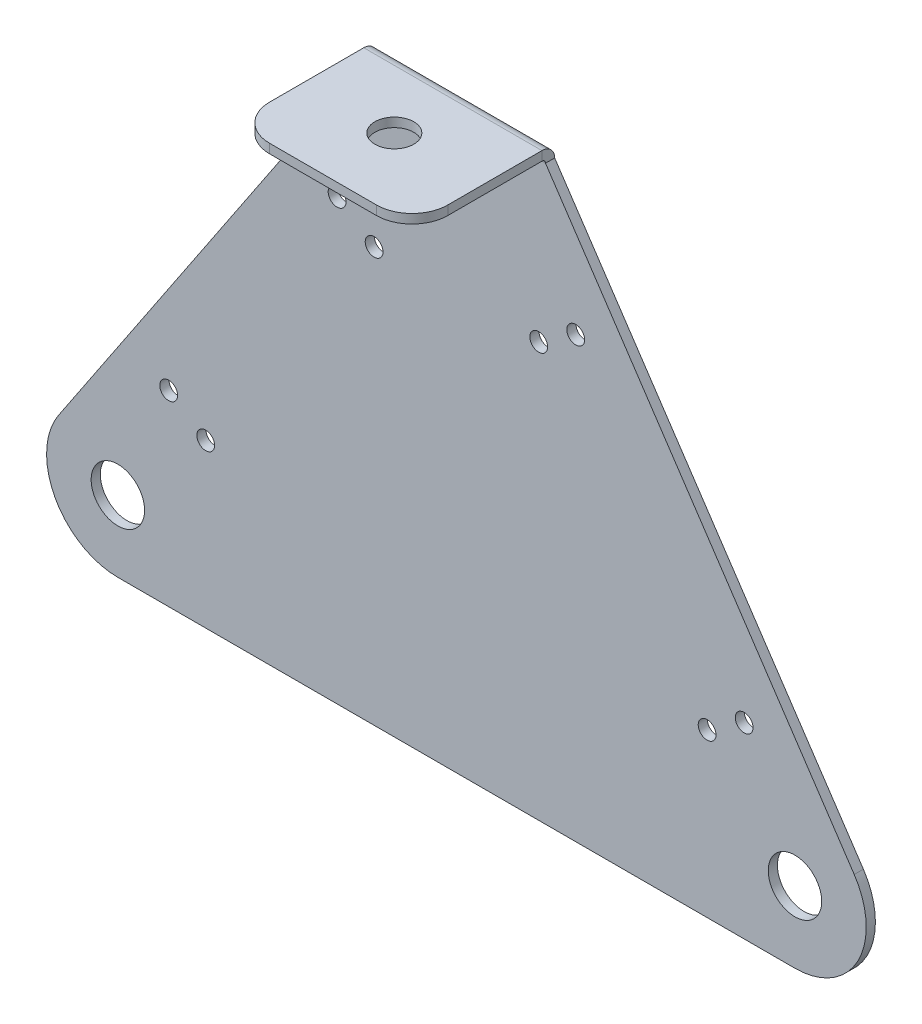
ISO-10303-21;
HEADER;
FILE_DESCRIPTION(('STEP AP214'),'2;1');
FILE_NAME('part.step','',(''),(''),'','','');
FILE_SCHEMA(('AUTOMOTIVE_DESIGN { 1 0 10303 214 1 1 1 1 }'));
ENDSEC;
DATA;
#1=APPLICATION_CONTEXT('core data for automotive mechanical design processes');
#2=APPLICATION_PROTOCOL_DEFINITION('international standard','automotive_design',2000,#1);
#3=PRODUCT_CONTEXT('',#1,'mechanical');
#4=PRODUCT('Part','Part','',(#3));
#5=PRODUCT_RELATED_PRODUCT_CATEGORY('part','',(#4));
#6=PRODUCT_DEFINITION_FORMATION('','',#4);
#7=PRODUCT_DEFINITION_CONTEXT('part definition',#1,'design');
#8=PRODUCT_DEFINITION('design','',#6,#7);
#9=PRODUCT_DEFINITION_SHAPE('','',#8);
#10=(LENGTH_UNIT() NAMED_UNIT(*) SI_UNIT(.MILLI.,.METRE.));
#11=(NAMED_UNIT(*) PLANE_ANGLE_UNIT() SI_UNIT($,.RADIAN.));
#12=(NAMED_UNIT(*) SI_UNIT($,.STERADIAN.) SOLID_ANGLE_UNIT());
#13=UNCERTAINTY_MEASURE_WITH_UNIT(LENGTH_MEASURE(1.E-05),#10,'distance_accuracy_value','');
#14=(GEOMETRIC_REPRESENTATION_CONTEXT(3) GLOBAL_UNCERTAINTY_ASSIGNED_CONTEXT((#13)) GLOBAL_UNIT_ASSIGNED_CONTEXT((#10,
#11,#12)) REPRESENTATION_CONTEXT('',''));
#15=CARTESIAN_POINT('',(0.,0.,0.));
#16=DIRECTION('',(0.,0.,1.));
#17=DIRECTION('',(1.,0.,0.));
#18=AXIS2_PLACEMENT_3D('',#15,#16,#17);
#19=CARTESIAN_POINT('',(-31.75,-30.356048,-3.2639));
#20=DIRECTION('',(-0.831233772338878,0.555923030394747,0.));
#21=DIRECTION('',(-0.555923030394747,-0.831233772338878,0.));
#22=AXIS2_PLACEMENT_3D('',#19,#20,#21);
#23=PLANE('',#22);
#24=DIRECTION('',(-0.555923030394747,-0.831233772338878,0.));
#25=VECTOR('',#24,1.);
#26=CARTESIAN_POINT('',(-31.75,-30.356048,0.));
#27=LINE('',#26,#25);
#28=CARTESIAN_POINT('',(-31.75,-30.356048,0.));
#29=VERTEX_POINT('',#28);
#30=CARTESIAN_POINT('',(-141.763337817408,-194.851484961158,0.));
#31=VERTEX_POINT('',#30);
#32=EDGE_CURVE('E261',#29,#31,#27,.T.);
#33=ORIENTED_EDGE('',*,*,#32,.F.);
#34=DIRECTION('',(0.,0.,1.));
#35=VECTOR('',#34,1.);
#36=CARTESIAN_POINT('',(-31.75,-30.356048,-3.2639));
#37=LINE('',#36,#35);
#38=CARTESIAN_POINT('',(-31.75,-30.356048,-3.2639));
#39=VERTEX_POINT('',#38);
#40=EDGE_CURVE('E297',#39,#29,#37,.T.);
#41=ORIENTED_EDGE('',*,*,#40,.F.);
#42=DIRECTION('',(-0.555923030394747,-0.831233772338878,0.));
#43=VECTOR('',#42,1.);
#44=CARTESIAN_POINT('',(-31.75,-30.356048,-3.2639));
#45=LINE('',#44,#43);
#46=CARTESIAN_POINT('',(-141.763337817408,-194.851484961158,-3.2639));
#47=VERTEX_POINT('',#46);
#48=EDGE_CURVE('E264',#39,#47,#45,.T.);
#49=ORIENTED_EDGE('',*,*,#48,.T.);
#50=DIRECTION('',(0.,0.,1.));
#51=VECTOR('',#50,1.);
#52=CARTESIAN_POINT('',(-141.763337817408,-194.851484961158,-3.2639));
#53=LINE('',#52,#51);
#54=EDGE_CURVE('E280',#47,#31,#53,.T.);
#55=ORIENTED_EDGE('',*,*,#54,.T.);
#56=EDGE_LOOP('',(#33,#41,#49,#55));
#57=FACE_BOUND('',#56,.T.);
#58=ADVANCED_FACE('F59',(#57),#23,.T.);
#59=CARTESIAN_POINT('',(31.75,-30.356048,-3.2639));
#60=DIRECTION('',(0.831233772338878,0.555923030394747,0.));
#61=DIRECTION('',(-0.555923030394747,0.831233772338878,0.));
#62=AXIS2_PLACEMENT_3D('',#59,#60,#61);
#63=PLANE('',#62);
#64=DIRECTION('',(-0.555923030394747,0.831233772338878,0.));
#65=VECTOR('',#64,1.);
#66=CARTESIAN_POINT('',(31.75,-30.356048,0.));
#67=LINE('',#66,#65);
#68=CARTESIAN_POINT('',(141.763337817408,-194.851484961158,0.));
#69=VERTEX_POINT('',#68);
#70=CARTESIAN_POINT('',(31.75,-30.356048,0.));
#71=VERTEX_POINT('',#70);
#72=EDGE_CURVE('E292',#69,#71,#67,.T.);
#73=ORIENTED_EDGE('',*,*,#72,.F.);
#74=DIRECTION('',(0.,0.,1.));
#75=VECTOR('',#74,1.);
#76=CARTESIAN_POINT('',(141.763337817408,-194.851484961158,-3.2639));
#77=LINE('',#76,#75);
#78=CARTESIAN_POINT('',(141.763337817408,-194.851484961158,-3.2639));
#79=VERTEX_POINT('',#78);
#80=EDGE_CURVE('E302',#79,#69,#77,.T.);
#81=ORIENTED_EDGE('',*,*,#80,.F.);
#82=DIRECTION('',(-0.555923030394747,0.831233772338878,0.));
#83=VECTOR('',#82,1.);
#84=CARTESIAN_POINT('',(31.75,-30.356048,-3.2639));
#85=LINE('',#84,#83);
#86=CARTESIAN_POINT('',(31.75,-30.356048,-3.2639));
#87=VERTEX_POINT('',#86);
#88=EDGE_CURVE('E277',#79,#87,#85,.T.);
#89=ORIENTED_EDGE('',*,*,#88,.T.);
#90=DIRECTION('',(0.,0.,1.));
#91=VECTOR('',#90,1.);
#92=CARTESIAN_POINT('',(31.75,-30.356048,-3.2639));
#93=LINE('',#92,#91);
#94=EDGE_CURVE('E300',#87,#71,#93,.T.);
#95=ORIENTED_EDGE('',*,*,#94,.T.);
#96=EDGE_LOOP('',(#73,#81,#89,#95));
#97=FACE_BOUND('',#96,.T.);
#98=ADVANCED_FACE('F344',(#97),#63,.T.);
#99=CARTESIAN_POINT('',(120.65,-208.971929933185,-3.2639));
#100=DIRECTION('',(0.,0.,1.));
#101=DIRECTION('',(1.,0.,0.));
#102=AXIS2_PLACEMENT_3D('',#99,#100,#101);
#103=CYLINDRICAL_SURFACE('',#102,25.4);
#104=CARTESIAN_POINT('',(120.65,-208.971929933185,0.));
#105=DIRECTION('',(0.,0.,1.));
#106=DIRECTION('',(-1.,0.,0.));
#107=AXIS2_PLACEMENT_3D('',#104,#105,#106);
#108=CIRCLE('',#107,25.4);
#109=CARTESIAN_POINT('',(120.65,-234.371929933185,0.));
#110=VERTEX_POINT('',#109);
#111=EDGE_CURVE('E289',#110,#69,#108,.T.);
#112=ORIENTED_EDGE('',*,*,#111,.F.);
#113=DIRECTION('',(0.,0.,1.));
#114=VECTOR('',#113,1.);
#115=CARTESIAN_POINT('',(120.65,-234.371929933185,-3.2639));
#116=LINE('',#115,#114);
#117=CARTESIAN_POINT('',(120.65,-234.371929933185,-3.2639));
#118=VERTEX_POINT('',#117);
#119=EDGE_CURVE('E304',#118,#110,#116,.T.);
#120=ORIENTED_EDGE('',*,*,#119,.F.);
#121=CARTESIAN_POINT('',(120.65,-208.971929933185,-3.2639));
#122=DIRECTION('',(0.,0.,1.));
#123=DIRECTION('',(-1.,0.,0.));
#124=AXIS2_PLACEMENT_3D('',#121,#122,#123);
#125=CIRCLE('',#124,25.4);
#126=EDGE_CURVE('E274',#118,#79,#125,.T.);
#127=ORIENTED_EDGE('',*,*,#126,.T.);
#128=ORIENTED_EDGE('',*,*,#80,.T.);
#129=EDGE_LOOP('',(#112,#120,#127,#128));
#130=FACE_BOUND('',#129,.T.);
#131=ADVANCED_FACE('F351',(#130),#103,.T.);
#132=CARTESIAN_POINT('',(-120.65,-234.371929933185,-3.2639));
#133=DIRECTION('',(0.,-1.,0.));
#134=DIRECTION('',(1.,0.,0.));
#135=AXIS2_PLACEMENT_3D('',#132,#133,#134);
#136=PLANE('',#135);
#137=DIRECTION('',(1.,0.,0.));
#138=VECTOR('',#137,1.);
#139=CARTESIAN_POINT('',(-120.65,-234.371929933185,0.));
#140=LINE('',#139,#138);
#141=CARTESIAN_POINT('',(-120.65,-234.371929933185,0.));
#142=VERTEX_POINT('',#141);
#143=EDGE_CURVE('E286',#142,#110,#140,.T.);
#144=ORIENTED_EDGE('',*,*,#143,.F.);
#145=DIRECTION('',(0.,0.,1.));
#146=VECTOR('',#145,1.);
#147=CARTESIAN_POINT('',(-120.65,-234.371929933185,-3.2639));
#148=LINE('',#147,#146);
#149=CARTESIAN_POINT('',(-120.65,-234.371929933185,-3.2639));
#150=VERTEX_POINT('',#149);
#151=EDGE_CURVE('E306',#150,#142,#148,.T.);
#152=ORIENTED_EDGE('',*,*,#151,.F.);
#153=DIRECTION('',(1.,0.,0.));
#154=VECTOR('',#153,1.);
#155=CARTESIAN_POINT('',(-120.65,-234.371929933185,-3.2639));
#156=LINE('',#155,#154);
#157=EDGE_CURVE('E271',#150,#118,#156,.T.);
#158=ORIENTED_EDGE('',*,*,#157,.T.);
#159=ORIENTED_EDGE('',*,*,#119,.T.);
#160=EDGE_LOOP('',(#144,#152,#158,#159));
#161=FACE_BOUND('',#160,.T.);
#162=ADVANCED_FACE('F363',(#161),#136,.T.);
#163=CARTESIAN_POINT('',(-120.65,-208.971929933185,-3.2639));
#164=DIRECTION('',(0.,0.,1.));
#165=DIRECTION('',(1.,0.,0.));
#166=AXIS2_PLACEMENT_3D('',#163,#164,#165);
#167=CYLINDRICAL_SURFACE('',#166,25.4);
#168=CARTESIAN_POINT('',(-120.65,-208.971929933185,0.));
#169=DIRECTION('',(0.,0.,1.));
#170=DIRECTION('',(1.,0.,0.));
#171=AXIS2_PLACEMENT_3D('',#168,#169,#170);
#172=CIRCLE('',#171,25.4);
#173=EDGE_CURVE('E283',#31,#142,#172,.T.);
#174=ORIENTED_EDGE('',*,*,#173,.F.);
#175=ORIENTED_EDGE('',*,*,#54,.F.);
#176=CARTESIAN_POINT('',(-120.65,-208.971929933185,-3.2639));
#177=DIRECTION('',(0.,0.,1.));
#178=DIRECTION('',(1.,0.,0.));
#179=AXIS2_PLACEMENT_3D('',#176,#177,#178);
#180=CIRCLE('',#179,25.4);
#181=EDGE_CURVE('E267',#47,#150,#180,.T.);
#182=ORIENTED_EDGE('',*,*,#181,.T.);
#183=ORIENTED_EDGE('',*,*,#151,.T.);
#184=EDGE_LOOP('',(#174,#175,#182,#183));
#185=FACE_BOUND('',#184,.T.);
#186=ADVANCED_FACE('F361',(#185),#167,.T.);
#187=CARTESIAN_POINT('',(-120.65,-208.971929933185,-3.2639));
#188=DIRECTION('',(0.,0.,1.));
#189=DIRECTION('',(1.,0.,0.));
#190=AXIS2_PLACEMENT_3D('',#187,#188,#189);
#191=PLANE('',#190);
#192=CARTESIAN_POINT('',(-102.537139366894,-167.610949698963,-3.2639));
#193=DIRECTION('',(0.,0.,1.));
#194=DIRECTION('',(1.,0.,0.));
#195=AXIS2_PLACEMENT_3D('',#192,#193,#194);
#196=CIRCLE('',#195,3.175);
#197=CARTESIAN_POINT('',(-99.3621393668936,-167.610949698963,-3.2639));
#198=VERTEX_POINT('',#197);
#199=EDGE_CURVE('E206',#198,#198,#196,.T.);
#200=ORIENTED_EDGE('',*,*,#199,.T.);
#201=EDGE_LOOP('',(#200));
#202=FACE_BOUND('',#201,.T.);
#203=CARTESIAN_POINT('',(-89.3413032310139,-176.43622780648,-3.2639));
#204=DIRECTION('',(0.,0.,1.));
#205=DIRECTION('',(1.,0.,0.));
#206=AXIS2_PLACEMENT_3D('',#203,#204,#205);
#207=CIRCLE('',#206,3.175);
#208=CARTESIAN_POINT('',(-86.1663032310139,-176.43622780648,-3.2639));
#209=VERTEX_POINT('',#208);
#210=EDGE_CURVE('E212',#209,#209,#207,.T.);
#211=ORIENTED_EDGE('',*,*,#210,.T.);
#212=EDGE_LOOP('',(#211));
#213=FACE_BOUND('',#212,.T.);
#214=CARTESIAN_POINT('',(-42.5252482357807,-77.8792639749816,-3.2639));
#215=DIRECTION('',(0.,0.,1.));
#216=DIRECTION('',(1.,0.,0.));
#217=AXIS2_PLACEMENT_3D('',#214,#215,#216);
#218=CIRCLE('',#217,3.175);
#219=CARTESIAN_POINT('',(-39.3502482357807,-77.8792639749816,-3.2639));
#220=VERTEX_POINT('',#219);
#221=EDGE_CURVE('E218',#220,#220,#218,.T.);
#222=ORIENTED_EDGE('',*,*,#221,.T.);
#223=EDGE_LOOP('',(#222));
#224=FACE_BOUND('',#223,.T.);
#225=CARTESIAN_POINT('',(-29.329412099901,-86.7045420824982,-3.2639));
#226=DIRECTION('',(0.,0.,1.));
#227=DIRECTION('',(1.,0.,0.));
#228=AXIS2_PLACEMENT_3D('',#225,#226,#227);
#229=CIRCLE('',#228,3.175);
#230=CARTESIAN_POINT('',(-26.154412099901,-86.7045420824982,-3.2639));
#231=VERTEX_POINT('',#230);
#232=EDGE_CURVE('E224',#231,#231,#229,.T.);
#233=ORIENTED_EDGE('',*,*,#232,.T.);
#234=EDGE_LOOP('',(#233));
#235=FACE_BOUND('',#234,.T.);
#236=CARTESIAN_POINT('',(29.3294120999009,-86.7045420824982,-3.2639));
#237=DIRECTION('',(0.,0.,1.));
#238=DIRECTION('',(1.,0.,0.));
#239=AXIS2_PLACEMENT_3D('',#236,#237,#238);
#240=CIRCLE('',#239,3.175);
#241=CARTESIAN_POINT('',(32.5044120999009,-86.7045420824982,-3.2639));
#242=VERTEX_POINT('',#241);
#243=EDGE_CURVE('E230',#242,#242,#240,.T.);
#244=ORIENTED_EDGE('',*,*,#243,.T.);
#245=EDGE_LOOP('',(#244));
#246=FACE_BOUND('',#245,.T.);
#247=CARTESIAN_POINT('',(42.5252482357807,-77.8792639749815,-3.2639));
#248=DIRECTION('',(0.,0.,1.));
#249=DIRECTION('',(1.,0.,0.));
#250=AXIS2_PLACEMENT_3D('',#247,#248,#249);
#251=CIRCLE('',#250,3.175);
#252=CARTESIAN_POINT('',(45.7002482357807,-77.8792639749815,-3.2639));
#253=VERTEX_POINT('',#252);
#254=EDGE_CURVE('E236',#253,#253,#251,.T.);
#255=ORIENTED_EDGE('',*,*,#254,.T.);
#256=EDGE_LOOP('',(#255));
#257=FACE_BOUND('',#256,.T.);
#258=CARTESIAN_POINT('',(89.3413032310139,-176.43622780648,-3.2639));
#259=DIRECTION('',(0.,0.,1.));
#260=DIRECTION('',(1.,0.,0.));
#261=AXIS2_PLACEMENT_3D('',#258,#259,#260);
#262=CIRCLE('',#261,3.175);
#263=CARTESIAN_POINT('',(92.5163032310139,-176.43622780648,-3.2639));
#264=VERTEX_POINT('',#263);
#265=EDGE_CURVE('E242',#264,#264,#262,.T.);
#266=ORIENTED_EDGE('',*,*,#265,.T.);
#267=EDGE_LOOP('',(#266));
#268=FACE_BOUND('',#267,.T.);
#269=CARTESIAN_POINT('',(102.537139366894,-167.610949698963,-3.2639));
#270=DIRECTION('',(0.,0.,1.));
#271=DIRECTION('',(1.,0.,0.));
#272=AXIS2_PLACEMENT_3D('',#269,#270,#271);
#273=CIRCLE('',#272,3.175);
#274=CARTESIAN_POINT('',(105.712139366894,-167.610949698963,-3.2639));
#275=VERTEX_POINT('',#274);
#276=EDGE_CURVE('E248',#275,#275,#273,.T.);
#277=ORIENTED_EDGE('',*,*,#276,.T.);
#278=EDGE_LOOP('',(#277));
#279=FACE_BOUND('',#278,.T.);
#280=CARTESIAN_POINT('',(120.65,-208.971929933185,-3.2639));
#281=DIRECTION('',(0.,0.,1.));
#282=DIRECTION('',(-1.,0.,0.));
#283=AXIS2_PLACEMENT_3D('',#280,#281,#282);
#284=CIRCLE('',#283,9.52499999999996);
#285=CARTESIAN_POINT('',(111.125,-208.971929933185,-3.2639));
#286=VERTEX_POINT('',#285);
#287=EDGE_CURVE('E252',#286,#286,#284,.T.);
#288=ORIENTED_EDGE('',*,*,#287,.T.);
#289=EDGE_LOOP('',(#288));
#290=FACE_BOUND('',#289,.T.);
#291=CARTESIAN_POINT('',(-120.65,-208.971929933185,-3.2639));
#292=DIRECTION('',(0.,0.,1.));
#293=DIRECTION('',(1.,0.,0.));
#294=AXIS2_PLACEMENT_3D('',#291,#292,#293);
#295=CIRCLE('',#294,9.525);
#296=CARTESIAN_POINT('',(-111.125,-208.971929933185,-3.2639));
#297=VERTEX_POINT('',#296);
#298=EDGE_CURVE('E258',#297,#297,#295,.T.);
#299=ORIENTED_EDGE('',*,*,#298,.T.);
#300=EDGE_LOOP('',(#299));
#301=FACE_BOUND('',#300,.T.);
#302=ORIENTED_EDGE('',*,*,#48,.F.);
#303=DIRECTION('',(-1.,0.,0.));
#304=VECTOR('',#303,1.);
#305=CARTESIAN_POINT('',(31.75,-30.356048,-3.2639));
#306=LINE('',#305,#304);
#307=EDGE_CURVE('E160',#87,#39,#306,.T.);
#308=ORIENTED_EDGE('',*,*,#307,.F.);
#309=ORIENTED_EDGE('',*,*,#88,.F.);
#310=ORIENTED_EDGE('',*,*,#126,.F.);
#311=ORIENTED_EDGE('',*,*,#157,.F.);
#312=ORIENTED_EDGE('',*,*,#181,.F.);
#313=EDGE_LOOP('',(#302,#308,#309,#310,#311,#312));
#314=FACE_BOUND('',#313,.T.);
#315=ADVANCED_FACE('F354',(#202,#213,#224,#235,#246,#257,#268,#279,#290,#301,#314),#191,.F.);
#316=CARTESIAN_POINT('',(-120.65,-208.971929933185,0.));
#317=DIRECTION('',(0.,0.,1.));
#318=DIRECTION('',(1.,0.,0.));
#319=AXIS2_PLACEMENT_3D('',#316,#317,#318);
#320=PLANE('',#319);
#321=CARTESIAN_POINT('',(-102.537139366894,-167.610949698963,0.));
#322=DIRECTION('',(0.,0.,1.));
#323=DIRECTION('',(1.,0.,0.));
#324=AXIS2_PLACEMENT_3D('',#321,#322,#323);
#325=CIRCLE('',#324,3.175);
#326=CARTESIAN_POINT('',(-99.3621393668936,-167.610949698963,0.));
#327=VERTEX_POINT('',#326);
#328=EDGE_CURVE('E199',#327,#327,#325,.T.);
#329=ORIENTED_EDGE('',*,*,#328,.F.);
#330=EDGE_LOOP('',(#329));
#331=FACE_BOUND('',#330,.T.);
#332=CARTESIAN_POINT('',(-89.3413032310139,-176.43622780648,0.));
#333=DIRECTION('',(0.,0.,1.));
#334=DIRECTION('',(1.,0.,0.));
#335=AXIS2_PLACEMENT_3D('',#332,#333,#334);
#336=CIRCLE('',#335,3.175);
#337=CARTESIAN_POINT('',(-86.1663032310139,-176.43622780648,0.));
#338=VERTEX_POINT('',#337);
#339=EDGE_CURVE('E209',#338,#338,#336,.T.);
#340=ORIENTED_EDGE('',*,*,#339,.F.);
#341=EDGE_LOOP('',(#340));
#342=FACE_BOUND('',#341,.T.);
#343=CARTESIAN_POINT('',(-42.5252482357807,-77.8792639749816,0.));
#344=DIRECTION('',(0.,0.,1.));
#345=DIRECTION('',(1.,0.,0.));
#346=AXIS2_PLACEMENT_3D('',#343,#344,#345);
#347=CIRCLE('',#346,3.175);
#348=CARTESIAN_POINT('',(-39.3502482357807,-77.8792639749816,0.));
#349=VERTEX_POINT('',#348);
#350=EDGE_CURVE('E215',#349,#349,#347,.T.);
#351=ORIENTED_EDGE('',*,*,#350,.F.);
#352=EDGE_LOOP('',(#351));
#353=FACE_BOUND('',#352,.T.);
#354=CARTESIAN_POINT('',(-29.329412099901,-86.7045420824982,0.));
#355=DIRECTION('',(0.,0.,1.));
#356=DIRECTION('',(1.,0.,0.));
#357=AXIS2_PLACEMENT_3D('',#354,#355,#356);
#358=CIRCLE('',#357,3.175);
#359=CARTESIAN_POINT('',(-26.154412099901,-86.7045420824982,0.));
#360=VERTEX_POINT('',#359);
#361=EDGE_CURVE('E221',#360,#360,#358,.T.);
#362=ORIENTED_EDGE('',*,*,#361,.F.);
#363=EDGE_LOOP('',(#362));
#364=FACE_BOUND('',#363,.T.);
#365=CARTESIAN_POINT('',(29.3294120999009,-86.7045420824982,0.));
#366=DIRECTION('',(0.,0.,1.));
#367=DIRECTION('',(1.,0.,0.));
#368=AXIS2_PLACEMENT_3D('',#365,#366,#367);
#369=CIRCLE('',#368,3.175);
#370=CARTESIAN_POINT('',(32.5044120999009,-86.7045420824982,0.));
#371=VERTEX_POINT('',#370);
#372=EDGE_CURVE('E227',#371,#371,#369,.T.);
#373=ORIENTED_EDGE('',*,*,#372,.F.);
#374=EDGE_LOOP('',(#373));
#375=FACE_BOUND('',#374,.T.);
#376=CARTESIAN_POINT('',(42.5252482357807,-77.8792639749815,0.));
#377=DIRECTION('',(0.,0.,1.));
#378=DIRECTION('',(1.,0.,0.));
#379=AXIS2_PLACEMENT_3D('',#376,#377,#378);
#380=CIRCLE('',#379,3.175);
#381=CARTESIAN_POINT('',(45.7002482357807,-77.8792639749815,0.));
#382=VERTEX_POINT('',#381);
#383=EDGE_CURVE('E233',#382,#382,#380,.T.);
#384=ORIENTED_EDGE('',*,*,#383,.F.);
#385=EDGE_LOOP('',(#384));
#386=FACE_BOUND('',#385,.T.);
#387=CARTESIAN_POINT('',(89.3413032310139,-176.43622780648,0.));
#388=DIRECTION('',(0.,0.,1.));
#389=DIRECTION('',(1.,0.,0.));
#390=AXIS2_PLACEMENT_3D('',#387,#388,#389);
#391=CIRCLE('',#390,3.175);
#392=CARTESIAN_POINT('',(92.5163032310139,-176.43622780648,0.));
#393=VERTEX_POINT('',#392);
#394=EDGE_CURVE('E239',#393,#393,#391,.T.);
#395=ORIENTED_EDGE('',*,*,#394,.F.);
#396=EDGE_LOOP('',(#395));
#397=FACE_BOUND('',#396,.T.);
#398=CARTESIAN_POINT('',(102.537139366894,-167.610949698963,0.));
#399=DIRECTION('',(0.,0.,1.));
#400=DIRECTION('',(1.,0.,0.));
#401=AXIS2_PLACEMENT_3D('',#398,#399,#400);
#402=CIRCLE('',#401,3.175);
#403=CARTESIAN_POINT('',(105.712139366894,-167.610949698963,0.));
#404=VERTEX_POINT('',#403);
#405=EDGE_CURVE('E245',#404,#404,#402,.T.);
#406=ORIENTED_EDGE('',*,*,#405,.F.);
#407=EDGE_LOOP('',(#406));
#408=FACE_BOUND('',#407,.T.);
#409=CARTESIAN_POINT('',(120.65,-208.971929933185,0.));
#410=DIRECTION('',(0.,0.,1.));
#411=DIRECTION('',(-1.,0.,0.));
#412=AXIS2_PLACEMENT_3D('',#409,#410,#411);
#413=CIRCLE('',#412,9.52499999999996);
#414=CARTESIAN_POINT('',(111.125,-208.971929933185,0.));
#415=VERTEX_POINT('',#414);
#416=EDGE_CURVE('E251',#415,#415,#413,.T.);
#417=ORIENTED_EDGE('',*,*,#416,.F.);
#418=EDGE_LOOP('',(#417));
#419=FACE_BOUND('',#418,.T.);
#420=CARTESIAN_POINT('',(-120.65,-208.971929933185,0.));
#421=DIRECTION('',(0.,0.,1.));
#422=DIRECTION('',(1.,0.,0.));
#423=AXIS2_PLACEMENT_3D('',#420,#421,#422);
#424=CIRCLE('',#423,9.525);
#425=CARTESIAN_POINT('',(-111.125,-208.971929933185,0.));
#426=VERTEX_POINT('',#425);
#427=EDGE_CURVE('E255',#426,#426,#424,.T.);
#428=ORIENTED_EDGE('',*,*,#427,.F.);
#429=EDGE_LOOP('',(#428));
#430=FACE_BOUND('',#429,.T.);
#431=ORIENTED_EDGE('',*,*,#32,.T.);
#432=ORIENTED_EDGE('',*,*,#173,.T.);
#433=ORIENTED_EDGE('',*,*,#143,.T.);
#434=ORIENTED_EDGE('',*,*,#111,.T.);
#435=ORIENTED_EDGE('',*,*,#72,.T.);
#436=DIRECTION('',(-1.,0.,0.));
#437=VECTOR('',#436,1.);
#438=CARTESIAN_POINT('',(31.75,-30.356048,0.));
#439=LINE('',#438,#437);
#440=EDGE_CURVE('E268',#71,#29,#439,.T.);
#441=ORIENTED_EDGE('',*,*,#440,.T.);
#442=EDGE_LOOP('',(#431,#432,#433,#434,#435,#441));
#443=FACE_BOUND('',#442,.T.);
#444=ADVANCED_FACE('F347',(#331,#342,#353,#364,#375,#386,#397,#408,#419,#430,#443),#320,.T.);
#445=CARTESIAN_POINT('',(-120.65,-208.971929933185,-3.2639));
#446=DIRECTION('',(0.,0.,1.));
#447=DIRECTION('',(1.,0.,0.));
#448=AXIS2_PLACEMENT_3D('',#445,#446,#447);
#449=CYLINDRICAL_SURFACE('',#448,9.525);
#450=ORIENTED_EDGE('',*,*,#298,.F.);
#451=EDGE_LOOP('',(#450));
#452=FACE_BOUND('',#451,.T.);
#453=ORIENTED_EDGE('',*,*,#427,.T.);
#454=EDGE_LOOP('',(#453));
#455=FACE_BOUND('',#454,.T.);
#456=ADVANCED_FACE('F446',(#452,#455),#449,.F.);
#457=CARTESIAN_POINT('',(120.65,-208.971929933185,-3.2639));
#458=DIRECTION('',(0.,0.,1.));
#459=DIRECTION('',(1.,0.,0.));
#460=AXIS2_PLACEMENT_3D('',#457,#458,#459);
#461=CYLINDRICAL_SURFACE('',#460,9.52499999999996);
#462=ORIENTED_EDGE('',*,*,#287,.F.);
#463=EDGE_LOOP('',(#462));
#464=FACE_BOUND('',#463,.T.);
#465=ORIENTED_EDGE('',*,*,#416,.T.);
#466=EDGE_LOOP('',(#465));
#467=FACE_BOUND('',#466,.T.);
#468=ADVANCED_FACE('F442',(#464,#467),#461,.F.);
#469=CARTESIAN_POINT('',(102.537139366894,-167.610949698963,0.));
#470=DIRECTION('',(0.,0.,1.));
#471=DIRECTION('',(1.,0.,0.));
#472=AXIS2_PLACEMENT_3D('',#469,#470,#471);
#473=CYLINDRICAL_SURFACE('',#472,3.175);
#474=ORIENTED_EDGE('',*,*,#276,.F.);
#475=EDGE_LOOP('',(#474));
#476=FACE_BOUND('',#475,.T.);
#477=ORIENTED_EDGE('',*,*,#405,.T.);
#478=EDGE_LOOP('',(#477));
#479=FACE_BOUND('',#478,.T.);
#480=ADVANCED_FACE('F438',(#476,#479),#473,.F.);
#481=CARTESIAN_POINT('',(89.3413032310139,-176.43622780648,0.));
#482=DIRECTION('',(0.,0.,1.));
#483=DIRECTION('',(1.,0.,0.));
#484=AXIS2_PLACEMENT_3D('',#481,#482,#483);
#485=CYLINDRICAL_SURFACE('',#484,3.175);
#486=ORIENTED_EDGE('',*,*,#265,.F.);
#487=EDGE_LOOP('',(#486));
#488=FACE_BOUND('',#487,.T.);
#489=ORIENTED_EDGE('',*,*,#394,.T.);
#490=EDGE_LOOP('',(#489));
#491=FACE_BOUND('',#490,.T.);
#492=ADVANCED_FACE('F434',(#488,#491),#485,.F.);
#493=CARTESIAN_POINT('',(42.5252482357807,-77.8792639749815,0.));
#494=DIRECTION('',(0.,0.,1.));
#495=DIRECTION('',(1.,0.,0.));
#496=AXIS2_PLACEMENT_3D('',#493,#494,#495);
#497=CYLINDRICAL_SURFACE('',#496,3.175);
#498=ORIENTED_EDGE('',*,*,#254,.F.);
#499=EDGE_LOOP('',(#498));
#500=FACE_BOUND('',#499,.T.);
#501=ORIENTED_EDGE('',*,*,#383,.T.);
#502=EDGE_LOOP('',(#501));
#503=FACE_BOUND('',#502,.T.);
#504=ADVANCED_FACE('F430',(#500,#503),#497,.F.);
#505=CARTESIAN_POINT('',(29.3294120999009,-86.7045420824982,0.));
#506=DIRECTION('',(0.,0.,1.));
#507=DIRECTION('',(1.,0.,0.));
#508=AXIS2_PLACEMENT_3D('',#505,#506,#507);
#509=CYLINDRICAL_SURFACE('',#508,3.175);
#510=ORIENTED_EDGE('',*,*,#243,.F.);
#511=EDGE_LOOP('',(#510));
#512=FACE_BOUND('',#511,.T.);
#513=ORIENTED_EDGE('',*,*,#372,.T.);
#514=EDGE_LOOP('',(#513));
#515=FACE_BOUND('',#514,.T.);
#516=ADVANCED_FACE('F426',(#512,#515),#509,.F.);
#517=CARTESIAN_POINT('',(-29.329412099901,-86.7045420824982,0.));
#518=DIRECTION('',(0.,0.,1.));
#519=DIRECTION('',(1.,0.,0.));
#520=AXIS2_PLACEMENT_3D('',#517,#518,#519);
#521=CYLINDRICAL_SURFACE('',#520,3.175);
#522=ORIENTED_EDGE('',*,*,#232,.F.);
#523=EDGE_LOOP('',(#522));
#524=FACE_BOUND('',#523,.T.);
#525=ORIENTED_EDGE('',*,*,#361,.T.);
#526=EDGE_LOOP('',(#525));
#527=FACE_BOUND('',#526,.T.);
#528=ADVANCED_FACE('F422',(#524,#527),#521,.F.);
#529=CARTESIAN_POINT('',(-42.5252482357807,-77.8792639749816,0.));
#530=DIRECTION('',(0.,0.,1.));
#531=DIRECTION('',(1.,0.,0.));
#532=AXIS2_PLACEMENT_3D('',#529,#530,#531);
#533=CYLINDRICAL_SURFACE('',#532,3.175);
#534=ORIENTED_EDGE('',*,*,#221,.F.);
#535=EDGE_LOOP('',(#534));
#536=FACE_BOUND('',#535,.T.);
#537=ORIENTED_EDGE('',*,*,#350,.T.);
#538=EDGE_LOOP('',(#537));
#539=FACE_BOUND('',#538,.T.);
#540=ADVANCED_FACE('F418',(#536,#539),#533,.F.);
#541=CARTESIAN_POINT('',(-89.3413032310139,-176.43622780648,0.));
#542=DIRECTION('',(0.,0.,1.));
#543=DIRECTION('',(1.,0.,0.));
#544=AXIS2_PLACEMENT_3D('',#541,#542,#543);
#545=CYLINDRICAL_SURFACE('',#544,3.175);
#546=ORIENTED_EDGE('',*,*,#210,.F.);
#547=EDGE_LOOP('',(#546));
#548=FACE_BOUND('',#547,.T.);
#549=ORIENTED_EDGE('',*,*,#339,.T.);
#550=EDGE_LOOP('',(#549));
#551=FACE_BOUND('',#550,.T.);
#552=ADVANCED_FACE('F414',(#548,#551),#545,.F.);
#553=CARTESIAN_POINT('',(-102.537139366894,-167.610949698963,0.));
#554=DIRECTION('',(0.,0.,1.));
#555=DIRECTION('',(1.,0.,0.));
#556=AXIS2_PLACEMENT_3D('',#553,#554,#555);
#557=CYLINDRICAL_SURFACE('',#556,3.175);
#558=ORIENTED_EDGE('',*,*,#199,.F.);
#559=EDGE_LOOP('',(#558));
#560=FACE_BOUND('',#559,.T.);
#561=ORIENTED_EDGE('',*,*,#328,.T.);
#562=EDGE_LOOP('',(#561));
#563=FACE_BOUND('',#562,.T.);
#564=ADVANCED_FACE('F409',(#560,#563),#557,.F.);
#565=CARTESIAN_POINT('',(31.75,-30.356048,1.27));
#566=DIRECTION('',(1.,0.,0.));
#567=DIRECTION('',(0.,0.,-1.));
#568=AXIS2_PLACEMENT_3D('',#565,#566,#567);
#569=PLANE('',#568);
#570=DIRECTION('',(0.,-1.,0.));
#571=VECTOR('',#570,1.);
#572=CARTESIAN_POINT('',(31.75,-25.822148,1.26999999999999));
#573=LINE('',#572,#571);
#574=CARTESIAN_POINT('',(31.75,-29.086048,1.27));
#575=VERTEX_POINT('',#574);
#576=CARTESIAN_POINT('',(31.75,-25.822148,1.26999999999998));
#577=VERTEX_POINT('',#576);
#578=EDGE_CURVE('E195',#575,#577,#573,.F.);
#579=ORIENTED_EDGE('',*,*,#578,.F.);
#580=CARTESIAN_POINT('',(31.75,-30.356048,1.27));
#581=DIRECTION('',(-1.,0.,0.));
#582=DIRECTION('',(0.,0.,1.));
#583=AXIS2_PLACEMENT_3D('',#580,#581,#582);
#584=CIRCLE('',#583,1.27);
#585=EDGE_CURVE('E164',#71,#575,#584,.F.);
#586=ORIENTED_EDGE('',*,*,#585,.F.);
#587=ORIENTED_EDGE('',*,*,#94,.F.);
#588=CARTESIAN_POINT('',(31.75,-30.356048,1.27));
#589=DIRECTION('',(-1.,0.,0.));
#590=DIRECTION('',(0.,0.,1.));
#591=AXIS2_PLACEMENT_3D('',#588,#589,#590);
#592=CIRCLE('',#591,4.5339);
#593=EDGE_CURVE('E163',#87,#577,#592,.F.);
#594=ORIENTED_EDGE('',*,*,#593,.T.);
#595=EDGE_LOOP('',(#579,#586,#587,#594));
#596=FACE_BOUND('',#595,.T.);
#597=ADVANCED_FACE('F341',(#596),#569,.T.);
#598=CARTESIAN_POINT('',(-31.75,-30.356048,1.27));
#599=DIRECTION('',(1.,0.,0.));
#600=DIRECTION('',(0.,0.,-1.));
#601=AXIS2_PLACEMENT_3D('',#598,#599,#600);
#602=PLANE('',#601);
#603=CARTESIAN_POINT('',(-31.75,-30.356048,1.27));
#604=DIRECTION('',(-1.,0.,0.));
#605=DIRECTION('',(0.,0.,1.));
#606=AXIS2_PLACEMENT_3D('',#603,#604,#605);
#607=CIRCLE('',#606,1.27);
#608=CARTESIAN_POINT('',(-31.75,-29.086048,1.27));
#609=VERTEX_POINT('',#608);
#610=EDGE_CURVE('E171',#609,#29,#607,.T.);
#611=ORIENTED_EDGE('',*,*,#610,.F.);
#612=DIRECTION('',(0.,-1.,0.));
#613=VECTOR('',#612,1.);
#614=CARTESIAN_POINT('',(-31.75,-29.086048,1.27));
#615=LINE('',#614,#613);
#616=CARTESIAN_POINT('',(-31.75,-25.822148,1.26999999999999));
#617=VERTEX_POINT('',#616);
#618=EDGE_CURVE('E168',#609,#617,#615,.F.);
#619=ORIENTED_EDGE('',*,*,#618,.T.);
#620=CARTESIAN_POINT('',(-31.75,-30.356048,1.27));
#621=DIRECTION('',(-1.,0.,0.));
#622=DIRECTION('',(0.,0.,1.));
#623=AXIS2_PLACEMENT_3D('',#620,#621,#622);
#624=CIRCLE('',#623,4.5339);
#625=EDGE_CURVE('E152',#617,#39,#624,.T.);
#626=ORIENTED_EDGE('',*,*,#625,.T.);
#627=ORIENTED_EDGE('',*,*,#40,.T.);
#628=EDGE_LOOP('',(#611,#619,#626,#627));
#629=FACE_BOUND('',#628,.T.);
#630=ADVANCED_FACE('F169',(#629),#602,.F.);
#631=CARTESIAN_POINT('',(-31.75,-30.356048,1.27));
#632=DIRECTION('',(-1.,0.,0.));
#633=DIRECTION('',(0.,1.,0.));
#634=AXIS2_PLACEMENT_3D('',#631,#632,#633);
#635=CYLINDRICAL_SURFACE('',#634,4.5339);
#636=ORIENTED_EDGE('',*,*,#307,.T.);
#637=ORIENTED_EDGE('',*,*,#625,.F.);
#638=DIRECTION('',(-1.,0.,0.));
#639=VECTOR('',#638,1.);
#640=CARTESIAN_POINT('',(31.75,-25.822148,1.26999999999999));
#641=LINE('',#640,#639);
#642=EDGE_CURVE('E157',#617,#577,#641,.F.);
#643=ORIENTED_EDGE('',*,*,#642,.T.);
#644=ORIENTED_EDGE('',*,*,#593,.F.);
#645=EDGE_LOOP('',(#636,#637,#643,#644));
#646=FACE_BOUND('',#645,.T.);
#647=ADVANCED_FACE('F154',(#646),#635,.T.);
#648=CARTESIAN_POINT('',(-31.75,-30.356048,1.27));
#649=DIRECTION('',(-1.,0.,0.));
#650=DIRECTION('',(0.,1.,0.));
#651=AXIS2_PLACEMENT_3D('',#648,#649,#650);
#652=CYLINDRICAL_SURFACE('',#651,1.27);
#653=ORIENTED_EDGE('',*,*,#440,.F.);
#654=ORIENTED_EDGE('',*,*,#585,.T.);
#655=DIRECTION('',(-1.,0.,0.));
#656=VECTOR('',#655,1.);
#657=CARTESIAN_POINT('',(31.75,-29.086048,1.27));
#658=LINE('',#657,#656);
#659=EDGE_CURVE('E173',#575,#609,#658,.T.);
#660=ORIENTED_EDGE('',*,*,#659,.T.);
#661=ORIENTED_EDGE('',*,*,#610,.T.);
#662=EDGE_LOOP('',(#653,#654,#660,#661));
#663=FACE_BOUND('',#662,.T.);
#664=ADVANCED_FACE('F337',(#663),#652,.F.);
#665=CARTESIAN_POINT('',(31.75,-25.822148,0.));
#666=DIRECTION('',(-1.,0.,0.));
#667=DIRECTION('',(0.,-1.,0.));
#668=AXIS2_PLACEMENT_3D('',#665,#666,#667);
#669=PLANE('',#668);
#670=DIRECTION('',(0.,0.,-1.));
#671=VECTOR('',#670,1.);
#672=CARTESIAN_POINT('',(31.75,-25.822148,0.));
#673=LINE('',#672,#671);
#674=CARTESIAN_POINT('',(31.75,-25.8221479999999,34.8361));
#675=VERTEX_POINT('',#674);
#676=EDGE_CURVE('E178',#675,#577,#673,.T.);
#677=ORIENTED_EDGE('',*,*,#676,.F.);
#678=DIRECTION('',(0.,-1.,0.));
#679=VECTOR('',#678,1.);
#680=CARTESIAN_POINT('',(31.75,-25.8221479999999,34.8361));
#681=LINE('',#680,#679);
#682=CARTESIAN_POINT('',(31.75,-29.0860479999999,34.8361));
#683=VERTEX_POINT('',#682);
#684=EDGE_CURVE('E13',#675,#683,#681,.T.);
#685=ORIENTED_EDGE('',*,*,#684,.T.);
#686=DIRECTION('',(0.,0.,1.));
#687=VECTOR('',#686,1.);
#688=CARTESIAN_POINT('',(31.75,-29.086048,0.));
#689=LINE('',#688,#687);
#690=EDGE_CURVE('E179',#683,#575,#689,.F.);
#691=ORIENTED_EDGE('',*,*,#690,.T.);
#692=ORIENTED_EDGE('',*,*,#578,.T.);
#693=EDGE_LOOP('',(#677,#685,#691,#692));
#694=FACE_BOUND('',#693,.T.);
#695=ADVANCED_FACE('F333',(#694),#669,.F.);
#696=CARTESIAN_POINT('',(-31.75,-25.8221479999998,47.5361));
#697=DIRECTION('',(1.,0.,0.));
#698=DIRECTION('',(0.,1.,0.));
#699=AXIS2_PLACEMENT_3D('',#696,#697,#698);
#700=PLANE('',#699);
#701=DIRECTION('',(0.,0.,-1.));
#702=VECTOR('',#701,1.);
#703=CARTESIAN_POINT('',(-31.75,-29.0860479999998,47.5361));
#704=LINE('',#703,#702);
#705=CARTESIAN_POINT('',(-31.75,-29.0860479999999,34.8361));
#706=VERTEX_POINT('',#705);
#707=EDGE_CURVE('E191',#609,#706,#704,.F.);
#708=ORIENTED_EDGE('',*,*,#707,.T.);
#709=DIRECTION('',(0.,-1.,0.));
#710=VECTOR('',#709,1.);
#711=CARTESIAN_POINT('',(-31.75,-25.8221479999999,34.8361));
#712=LINE('',#711,#710);
#713=CARTESIAN_POINT('',(-31.75,-25.8221479999999,34.8361));
#714=VERTEX_POINT('',#713);
#715=EDGE_CURVE('E82',#706,#714,#712,.F.);
#716=ORIENTED_EDGE('',*,*,#715,.T.);
#717=DIRECTION('',(0.,0.,1.));
#718=VECTOR('',#717,1.);
#719=CARTESIAN_POINT('',(-31.75,-25.822148,0.));
#720=LINE('',#719,#718);
#721=EDGE_CURVE('E176',#617,#714,#720,.T.);
#722=ORIENTED_EDGE('',*,*,#721,.F.);
#723=ORIENTED_EDGE('',*,*,#618,.F.);
#724=EDGE_LOOP('',(#708,#716,#722,#723));
#725=FACE_BOUND('',#724,.T.);
#726=ADVANCED_FACE('F181',(#725),#700,.F.);
#727=CARTESIAN_POINT('',(0.,-25.822148,0.));
#728=DIRECTION('',(0.,-1.,0.));
#729=DIRECTION('',(0.,0.,-1.));
#730=AXIS2_PLACEMENT_3D('',#727,#728,#729);
#731=PLANE('',#730);
#732=CARTESIAN_POINT('',(0.,-25.8221479999999,22.1360999999994));
#733=DIRECTION('',(0.,1.,0.));
#734=DIRECTION('',(0.,0.,1.));
#735=AXIS2_PLACEMENT_3D('',#732,#733,#734);
#736=CIRCLE('',#735,6.94562999999998);
#737=CARTESIAN_POINT('',(0.,-25.8221479999999,29.0817299999994));
#738=VERTEX_POINT('',#737);
#739=EDGE_CURVE('E708',#738,#738,#736,.T.);
#740=ORIENTED_EDGE('',*,*,#739,.F.);
#741=EDGE_LOOP('',(#740));
#742=FACE_BOUND('',#741,.T.);
#743=ORIENTED_EDGE('',*,*,#721,.T.);
#744=CARTESIAN_POINT('',(-19.05,-25.8221479999999,34.8361));
#745=DIRECTION('',(0.,-1.,0.));
#746=DIRECTION('',(0.,0.,-1.));
#747=AXIS2_PLACEMENT_3D('',#744,#745,#746);
#748=CIRCLE('',#747,12.7);
#749=CARTESIAN_POINT('',(-19.05,-25.8221479999998,47.5361));
#750=VERTEX_POINT('',#749);
#751=EDGE_CURVE('E67',#714,#750,#748,.F.);
#752=ORIENTED_EDGE('',*,*,#751,.T.);
#753=DIRECTION('',(1.,0.,0.));
#754=VECTOR('',#753,1.);
#755=CARTESIAN_POINT('',(0.,-25.8221479999998,47.5361));
#756=LINE('',#755,#754);
#757=CARTESIAN_POINT('',(19.05,-25.8221479999998,47.5361));
#758=VERTEX_POINT('',#757);
#759=EDGE_CURVE('E182',#750,#758,#756,.T.);
#760=ORIENTED_EDGE('',*,*,#759,.T.);
#761=CARTESIAN_POINT('',(19.05,-25.8221479999999,34.8361));
#762=DIRECTION('',(0.,-1.,0.));
#763=DIRECTION('',(0.,0.,-1.));
#764=AXIS2_PLACEMENT_3D('',#761,#762,#763);
#765=CIRCLE('',#764,12.7);
#766=EDGE_CURVE('E74',#758,#675,#765,.F.);
#767=ORIENTED_EDGE('',*,*,#766,.T.);
#768=ORIENTED_EDGE('',*,*,#676,.T.);
#769=ORIENTED_EDGE('',*,*,#642,.F.);
#770=EDGE_LOOP('',(#743,#752,#760,#767,#768,#769));
#771=FACE_BOUND('',#770,.T.);
#772=ADVANCED_FACE('F175',(#742,#771),#731,.F.);
#773=CARTESIAN_POINT('',(0.,-29.086048,1.06346492748332E-13));
#774=DIRECTION('',(0.,-1.,0.));
#775=DIRECTION('',(0.,0.,-1.));
#776=AXIS2_PLACEMENT_3D('',#773,#774,#775);
#777=PLANE('',#776);
#778=CARTESIAN_POINT('',(0.,-29.0860479999999,22.1360999999994));
#779=DIRECTION('',(0.,-1.,0.));
#780=DIRECTION('',(0.,0.,-1.));
#781=AXIS2_PLACEMENT_3D('',#778,#779,#780);
#782=CIRCLE('',#781,6.94562999999999);
#783=CARTESIAN_POINT('',(0.,-29.0860479999999,15.1904699999994));
#784=VERTEX_POINT('',#783);
#785=EDGE_CURVE('E198',#784,#784,#782,.T.);
#786=ORIENTED_EDGE('',*,*,#785,.F.);
#787=EDGE_LOOP('',(#786));
#788=FACE_BOUND('',#787,.T.);
#789=DIRECTION('',(-1.,0.,0.));
#790=VECTOR('',#789,1.);
#791=CARTESIAN_POINT('',(31.75,-29.0860479999998,47.5361));
#792=LINE('',#791,#790);
#793=CARTESIAN_POINT('',(-19.05,-29.0860479999998,47.5361));
#794=VERTEX_POINT('',#793);
#795=CARTESIAN_POINT('',(19.05,-29.0860479999998,47.5361));
#796=VERTEX_POINT('',#795);
#797=EDGE_CURVE('E185',#794,#796,#792,.F.);
#798=ORIENTED_EDGE('',*,*,#797,.F.);
#799=CARTESIAN_POINT('',(-19.05,-29.0860479999999,34.8361));
#800=DIRECTION('',(0.,-1.,0.));
#801=DIRECTION('',(0.,0.,-1.));
#802=AXIS2_PLACEMENT_3D('',#799,#800,#801);
#803=CIRCLE('',#802,12.7);
#804=EDGE_CURVE('E315',#794,#706,#803,.T.);
#805=ORIENTED_EDGE('',*,*,#804,.T.);
#806=ORIENTED_EDGE('',*,*,#707,.F.);
#807=ORIENTED_EDGE('',*,*,#659,.F.);
#808=ORIENTED_EDGE('',*,*,#690,.F.);
#809=CARTESIAN_POINT('',(19.05,-29.0860479999999,34.8361));
#810=DIRECTION('',(0.,-1.,0.));
#811=DIRECTION('',(0.,0.,-1.));
#812=AXIS2_PLACEMENT_3D('',#809,#810,#811);
#813=CIRCLE('',#812,12.7);
#814=EDGE_CURVE('E313',#683,#796,#813,.T.);
#815=ORIENTED_EDGE('',*,*,#814,.T.);
#816=EDGE_LOOP('',(#798,#805,#806,#807,#808,#815));
#817=FACE_BOUND('',#816,.T.);
#818=ADVANCED_FACE('F327',(#788,#817),#777,.T.);
#819=CARTESIAN_POINT('',(31.75,-25.8221479999998,47.5361));
#820=DIRECTION('',(0.,0.,-1.));
#821=DIRECTION('',(0.,1.,0.));
#822=AXIS2_PLACEMENT_3D('',#819,#820,#821);
#823=PLANE('',#822);
#824=ORIENTED_EDGE('',*,*,#759,.F.);
#825=DIRECTION('',(0.,-1.,0.));
#826=VECTOR('',#825,1.);
#827=CARTESIAN_POINT('',(-19.05,-25.8221479999998,47.5361));
#828=LINE('',#827,#826);
#829=EDGE_CURVE('E310',#750,#794,#828,.T.);
#830=ORIENTED_EDGE('',*,*,#829,.T.);
#831=ORIENTED_EDGE('',*,*,#797,.T.);
#832=DIRECTION('',(0.,-1.,0.));
#833=VECTOR('',#832,1.);
#834=CARTESIAN_POINT('',(19.05,-25.8221479999998,47.5361));
#835=LINE('',#834,#833);
#836=EDGE_CURVE('E299',#796,#758,#835,.F.);
#837=ORIENTED_EDGE('',*,*,#836,.T.);
#838=EDGE_LOOP('',(#824,#830,#831,#837));
#839=FACE_BOUND('',#838,.T.);
#840=ADVANCED_FACE('F322',(#839),#823,.F.);
#841=CARTESIAN_POINT('',(0.,-25.8221479999999,22.1360999999994));
#842=DIRECTION('',(0.,1.,0.));
#843=DIRECTION('',(0.,0.,1.));
#844=AXIS2_PLACEMENT_3D('',#841,#842,#843);
#845=CYLINDRICAL_SURFACE('',#844,6.94562999999999);
#846=ORIENTED_EDGE('',*,*,#739,.T.);
#847=EDGE_LOOP('',(#846));
#848=FACE_BOUND('',#847,.T.);
#849=ORIENTED_EDGE('',*,*,#785,.T.);
#850=EDGE_LOOP('',(#849));
#851=FACE_BOUND('',#850,.T.);
#852=ADVANCED_FACE('F379',(#848,#851),#845,.F.);
#853=CARTESIAN_POINT('',(-19.05,-25.8221479999999,34.8361));
#854=DIRECTION('',(0.,-1.,0.));
#855=DIRECTION('',(0.,0.,-1.));
#856=AXIS2_PLACEMENT_3D('',#853,#854,#855);
#857=CYLINDRICAL_SURFACE('',#856,12.7);
#858=ORIENTED_EDGE('',*,*,#751,.F.);
#859=ORIENTED_EDGE('',*,*,#715,.F.);
#860=ORIENTED_EDGE('',*,*,#804,.F.);
#861=ORIENTED_EDGE('',*,*,#829,.F.);
#862=EDGE_LOOP('',(#858,#859,#860,#861));
#863=FACE_BOUND('',#862,.T.);
#864=ADVANCED_FACE('F325',(#863),#857,.T.);
#865=CARTESIAN_POINT('',(19.05,-25.8221479999999,34.8361));
#866=DIRECTION('',(0.,-1.,0.));
#867=DIRECTION('',(0.,0.,-1.));
#868=AXIS2_PLACEMENT_3D('',#865,#866,#867);
#869=CYLINDRICAL_SURFACE('',#868,12.7);
#870=ORIENTED_EDGE('',*,*,#766,.F.);
#871=ORIENTED_EDGE('',*,*,#836,.F.);
#872=ORIENTED_EDGE('',*,*,#814,.F.);
#873=ORIENTED_EDGE('',*,*,#684,.F.);
#874=EDGE_LOOP('',(#870,#871,#872,#873));
#875=FACE_BOUND('',#874,.T.);
#876=ADVANCED_FACE('F61',(#875),#869,.T.);
#877=CLOSED_SHELL('',(#58,#98,#131,#162,#186,#315,#444,#456,#468,#480,#492,#504,#516,#528,#540,
#552,#564,#597,#630,#647,#664,#695,#726,#772,#818,#840,#852,#864,#876));
#878=MANIFOLD_SOLID_BREP('B2',#877);
#879=ADVANCED_BREP_SHAPE_REPRESENTATION('',(#18,#878),#14);
#880=SHAPE_DEFINITION_REPRESENTATION(#9,#879);
ENDSEC;
END-ISO-10303-21;
